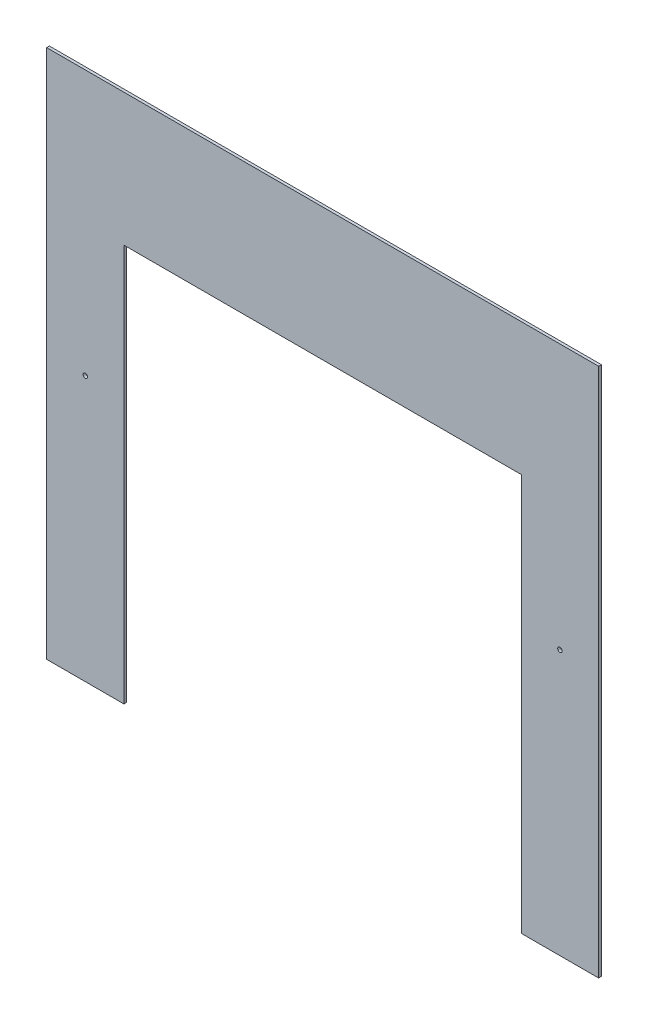
ISO-10303-21;
HEADER;
FILE_DESCRIPTION(('STEP AP214'),'2;1');
FILE_NAME('part.step','',(''),(''),'','','');
FILE_SCHEMA(('AUTOMOTIVE_DESIGN { 1 0 10303 214 1 1 1 1 }'));
ENDSEC;
DATA;
#1=APPLICATION_CONTEXT('core data for automotive mechanical design processes');
#2=APPLICATION_PROTOCOL_DEFINITION('international standard','automotive_design',2000,#1);
#3=PRODUCT_CONTEXT('',#1,'mechanical');
#4=PRODUCT('Part','Part','',(#3));
#5=PRODUCT_RELATED_PRODUCT_CATEGORY('part','',(#4));
#6=PRODUCT_DEFINITION_FORMATION('','',#4);
#7=PRODUCT_DEFINITION_CONTEXT('part definition',#1,'design');
#8=PRODUCT_DEFINITION('design','',#6,#7);
#9=PRODUCT_DEFINITION_SHAPE('','',#8);
#10=(LENGTH_UNIT() NAMED_UNIT(*) SI_UNIT(.MILLI.,.METRE.));
#11=(NAMED_UNIT(*) PLANE_ANGLE_UNIT() SI_UNIT($,.RADIAN.));
#12=(NAMED_UNIT(*) SI_UNIT($,.STERADIAN.) SOLID_ANGLE_UNIT());
#13=UNCERTAINTY_MEASURE_WITH_UNIT(LENGTH_MEASURE(1.E-05),#10,'distance_accuracy_value','');
#14=(GEOMETRIC_REPRESENTATION_CONTEXT(3) GLOBAL_UNCERTAINTY_ASSIGNED_CONTEXT((#13)) GLOBAL_UNIT_ASSIGNED_CONTEXT((#10,
#11,#12)) REPRESENTATION_CONTEXT('',''));
#15=CARTESIAN_POINT('',(0.,0.,0.));
#16=DIRECTION('',(0.,0.,1.));
#17=DIRECTION('',(1.,0.,0.));
#18=AXIS2_PLACEMENT_3D('',#15,#16,#17);
#19=CARTESIAN_POINT('',(-441.395750599632,36.4853300733494,3.175));
#20=DIRECTION('',(1.,0.,0.));
#21=DIRECTION('',(0.,0.,-1.));
#22=AXIS2_PLACEMENT_3D('',#19,#20,#21);
#23=PLANE('',#22);
#24=DIRECTION('',(0.,-1.,0.));
#25=VECTOR('',#24,1.);
#26=CARTESIAN_POINT('',(-441.395750599632,36.4853300733494,0.));
#27=LINE('',#26,#25);
#28=CARTESIAN_POINT('',(-441.395750599632,526.537652811736,0.));
#29=VERTEX_POINT('',#28);
#30=CARTESIAN_POINT('',(-441.395750599632,-83.0623471882642,0.));
#31=VERTEX_POINT('',#30);
#32=EDGE_CURVE('E88',#29,#31,#27,.T.);
#33=ORIENTED_EDGE('',*,*,#32,.T.);
#34=DIRECTION('',(0.,0.,-1.));
#35=VECTOR('',#34,1.);
#36=CARTESIAN_POINT('',(-441.395750599632,-83.0623471882642,3.175));
#37=LINE('',#36,#35);
#38=CARTESIAN_POINT('',(-441.395750599632,-83.0623471882642,3.175));
#39=VERTEX_POINT('',#38);
#40=EDGE_CURVE('E11',#39,#31,#37,.T.);
#41=ORIENTED_EDGE('',*,*,#40,.F.);
#42=DIRECTION('',(0.,-1.,0.));
#43=VECTOR('',#42,1.);
#44=CARTESIAN_POINT('',(-441.395750599632,36.4853300733494,3.175));
#45=LINE('',#44,#43);
#46=CARTESIAN_POINT('',(-441.395750599632,526.537652811736,3.175));
#47=VERTEX_POINT('',#46);
#48=EDGE_CURVE('E94',#47,#39,#45,.T.);
#49=ORIENTED_EDGE('',*,*,#48,.F.);
#50=DIRECTION('',(0.,0.,-1.));
#51=VECTOR('',#50,1.);
#52=CARTESIAN_POINT('',(-441.395750599632,526.537652811736,3.175));
#53=LINE('',#52,#51);
#54=EDGE_CURVE('E128',#47,#29,#53,.T.);
#55=ORIENTED_EDGE('',*,*,#54,.T.);
#56=EDGE_LOOP('',(#33,#41,#49,#55));
#57=FACE_BOUND('',#56,.T.);
#58=ADVANCED_FACE('F36',(#57),#23,.F.);
#59=CARTESIAN_POINT('',(-441.395750599632,-83.0623471882642,3.175));
#60=DIRECTION('',(0.,1.,0.));
#61=DIRECTION('',(0.,0.,1.));
#62=AXIS2_PLACEMENT_3D('',#59,#60,#61);
#63=PLANE('',#62);
#64=DIRECTION('',(1.,0.,0.));
#65=VECTOR('',#64,1.);
#66=CARTESIAN_POINT('',(-441.395750599632,-83.0623471882642,0.));
#67=LINE('',#66,#65);
#68=CARTESIAN_POINT('',(-352.495750599632,-83.0623471882642,0.));
#69=VERTEX_POINT('',#68);
#70=EDGE_CURVE('E133',#31,#69,#67,.T.);
#71=ORIENTED_EDGE('',*,*,#70,.T.);
#72=DIRECTION('',(0.,0.,-1.));
#73=VECTOR('',#72,1.);
#74=CARTESIAN_POINT('',(-352.495750599632,-83.0623471882642,3.175));
#75=LINE('',#74,#73);
#76=CARTESIAN_POINT('',(-352.495750599632,-83.0623471882642,3.175));
#77=VERTEX_POINT('',#76);
#78=EDGE_CURVE('E44',#77,#69,#75,.T.);
#79=ORIENTED_EDGE('',*,*,#78,.F.);
#80=DIRECTION('',(1.,0.,0.));
#81=VECTOR('',#80,1.);
#82=CARTESIAN_POINT('',(-441.395750599632,-83.0623471882642,3.175));
#83=LINE('',#82,#81);
#84=EDGE_CURVE('E178',#39,#77,#83,.T.);
#85=ORIENTED_EDGE('',*,*,#84,.F.);
#86=ORIENTED_EDGE('',*,*,#40,.T.);
#87=EDGE_LOOP('',(#71,#79,#85,#86));
#88=FACE_BOUND('',#87,.T.);
#89=ADVANCED_FACE('F218',(#88),#63,.F.);
#90=CARTESIAN_POINT('',(-352.495750599632,-83.0623471882642,3.175));
#91=DIRECTION('',(-1.,0.,0.));
#92=DIRECTION('',(0.,0.,1.));
#93=AXIS2_PLACEMENT_3D('',#90,#91,#92);
#94=PLANE('',#93);
#95=DIRECTION('',(0.,1.,0.));
#96=VECTOR('',#95,1.);
#97=CARTESIAN_POINT('',(-352.495750599632,-83.0623471882642,0.));
#98=LINE('',#97,#96);
#99=CARTESIAN_POINT('',(-352.495750599632,374.137652811736,0.));
#100=VERTEX_POINT('',#99);
#101=EDGE_CURVE('E136',#69,#100,#98,.T.);
#102=ORIENTED_EDGE('',*,*,#101,.T.);
#103=DIRECTION('',(0.,0.,-1.));
#104=VECTOR('',#103,1.);
#105=CARTESIAN_POINT('',(-352.495750599632,374.137652811736,3.175));
#106=LINE('',#105,#104);
#107=CARTESIAN_POINT('',(-352.495750599632,374.137652811736,3.175));
#108=VERTEX_POINT('',#107);
#109=EDGE_CURVE('E153',#108,#100,#106,.T.);
#110=ORIENTED_EDGE('',*,*,#109,.F.);
#111=DIRECTION('',(0.,1.,0.));
#112=VECTOR('',#111,1.);
#113=CARTESIAN_POINT('',(-352.495750599632,-83.0623471882642,3.175));
#114=LINE('',#113,#112);
#115=EDGE_CURVE('E162',#77,#108,#114,.T.);
#116=ORIENTED_EDGE('',*,*,#115,.F.);
#117=ORIENTED_EDGE('',*,*,#78,.T.);
#118=EDGE_LOOP('',(#102,#110,#116,#117));
#119=FACE_BOUND('',#118,.T.);
#120=ADVANCED_FACE('F160',(#119),#94,.F.);
#121=CARTESIAN_POINT('',(-352.495750599632,374.137652811736,3.175));
#122=DIRECTION('',(0.,1.,0.));
#123=DIRECTION('',(0.,0.,1.));
#124=AXIS2_PLACEMENT_3D('',#121,#122,#123);
#125=PLANE('',#124);
#126=DIRECTION('',(1.,0.,0.));
#127=VECTOR('',#126,1.);
#128=CARTESIAN_POINT('',(-352.495750599632,374.137652811736,0.));
#129=LINE('',#128,#127);
#130=CARTESIAN_POINT('',(104.704249400368,374.137652811736,0.));
#131=VERTEX_POINT('',#130);
#132=EDGE_CURVE('E138',#100,#131,#129,.T.);
#133=ORIENTED_EDGE('',*,*,#132,.T.);
#134=DIRECTION('',(0.,0.,-1.));
#135=VECTOR('',#134,1.);
#136=CARTESIAN_POINT('',(104.704249400368,374.137652811736,3.175));
#137=LINE('',#136,#135);
#138=CARTESIAN_POINT('',(104.704249400368,374.137652811736,3.175));
#139=VERTEX_POINT('',#138);
#140=EDGE_CURVE('E150',#139,#131,#137,.T.);
#141=ORIENTED_EDGE('',*,*,#140,.F.);
#142=DIRECTION('',(1.,0.,0.));
#143=VECTOR('',#142,1.);
#144=CARTESIAN_POINT('',(-352.495750599632,374.137652811736,3.175));
#145=LINE('',#144,#143);
#146=EDGE_CURVE('E174',#108,#139,#145,.T.);
#147=ORIENTED_EDGE('',*,*,#146,.F.);
#148=ORIENTED_EDGE('',*,*,#109,.T.);
#149=EDGE_LOOP('',(#133,#141,#147,#148));
#150=FACE_BOUND('',#149,.T.);
#151=ADVANCED_FACE('F170',(#150),#125,.F.);
#152=CARTESIAN_POINT('',(104.704249400368,-83.0623471882642,3.175));
#153=DIRECTION('',(1.,0.,0.));
#154=DIRECTION('',(0.,1.,0.));
#155=AXIS2_PLACEMENT_3D('',#152,#153,#154);
#156=PLANE('',#155);
#157=DIRECTION('',(0.,-1.,0.));
#158=VECTOR('',#157,1.);
#159=CARTESIAN_POINT('',(104.704249400368,-83.0623471882642,0.));
#160=LINE('',#159,#158);
#161=CARTESIAN_POINT('',(104.704249400368,-83.0623471882642,0.));
#162=VERTEX_POINT('',#161);
#163=EDGE_CURVE('E140',#131,#162,#160,.T.);
#164=ORIENTED_EDGE('',*,*,#163,.T.);
#165=DIRECTION('',(0.,0.,-1.));
#166=VECTOR('',#165,1.);
#167=CARTESIAN_POINT('',(104.704249400368,-83.0623471882642,3.175));
#168=LINE('',#167,#166);
#169=CARTESIAN_POINT('',(104.704249400368,-83.0623471882642,3.175));
#170=VERTEX_POINT('',#169);
#171=EDGE_CURVE('E123',#170,#162,#168,.T.);
#172=ORIENTED_EDGE('',*,*,#171,.F.);
#173=DIRECTION('',(0.,-1.,0.));
#174=VECTOR('',#173,1.);
#175=CARTESIAN_POINT('',(104.704249400368,-83.0623471882642,3.175));
#176=LINE('',#175,#174);
#177=EDGE_CURVE('E114',#139,#170,#176,.T.);
#178=ORIENTED_EDGE('',*,*,#177,.F.);
#179=ORIENTED_EDGE('',*,*,#140,.T.);
#180=EDGE_LOOP('',(#164,#172,#178,#179));
#181=FACE_BOUND('',#180,.T.);
#182=ADVANCED_FACE('F173',(#181),#156,.F.);
#183=CARTESIAN_POINT('',(193.604249400368,-83.0623471882642,3.175));
#184=DIRECTION('',(0.,1.,0.));
#185=DIRECTION('',(0.,0.,1.));
#186=AXIS2_PLACEMENT_3D('',#183,#184,#185);
#187=PLANE('',#186);
#188=DIRECTION('',(1.,0.,0.));
#189=VECTOR('',#188,1.);
#190=CARTESIAN_POINT('',(193.604249400368,-83.0623471882642,0.));
#191=LINE('',#190,#189);
#192=CARTESIAN_POINT('',(193.604249400368,-83.0623471882642,0.));
#193=VERTEX_POINT('',#192);
#194=EDGE_CURVE('E122',#162,#193,#191,.T.);
#195=ORIENTED_EDGE('',*,*,#194,.T.);
#196=DIRECTION('',(0.,0.,-1.));
#197=VECTOR('',#196,1.);
#198=CARTESIAN_POINT('',(193.604249400368,-83.0623471882642,3.175));
#199=LINE('',#198,#197);
#200=CARTESIAN_POINT('',(193.604249400368,-83.0623471882642,3.175));
#201=VERTEX_POINT('',#200);
#202=EDGE_CURVE('E119',#201,#193,#199,.T.);
#203=ORIENTED_EDGE('',*,*,#202,.F.);
#204=DIRECTION('',(1.,0.,0.));
#205=VECTOR('',#204,1.);
#206=CARTESIAN_POINT('',(193.604249400368,-83.0623471882642,3.175));
#207=LINE('',#206,#205);
#208=EDGE_CURVE('E108',#170,#201,#207,.T.);
#209=ORIENTED_EDGE('',*,*,#208,.F.);
#210=ORIENTED_EDGE('',*,*,#171,.T.);
#211=EDGE_LOOP('',(#195,#203,#209,#210));
#212=FACE_BOUND('',#211,.T.);
#213=ADVANCED_FACE('F120',(#212),#187,.F.);
#214=CARTESIAN_POINT('',(193.604249400368,526.537652811736,3.175));
#215=DIRECTION('',(-1.,0.,0.));
#216=DIRECTION('',(0.,-1.,0.));
#217=AXIS2_PLACEMENT_3D('',#214,#215,#216);
#218=PLANE('',#217);
#219=DIRECTION('',(0.,1.,0.));
#220=VECTOR('',#219,1.);
#221=CARTESIAN_POINT('',(193.604249400368,526.537652811736,0.));
#222=LINE('',#221,#220);
#223=CARTESIAN_POINT('',(193.604249400368,526.537652811736,0.));
#224=VERTEX_POINT('',#223);
#225=EDGE_CURVE('E81',#193,#224,#222,.T.);
#226=ORIENTED_EDGE('',*,*,#225,.T.);
#227=DIRECTION('',(0.,0.,-1.));
#228=VECTOR('',#227,1.);
#229=CARTESIAN_POINT('',(193.604249400368,526.537652811736,3.175));
#230=LINE('',#229,#228);
#231=CARTESIAN_POINT('',(193.604249400368,526.537652811736,3.175));
#232=VERTEX_POINT('',#231);
#233=EDGE_CURVE('E124',#232,#224,#230,.T.);
#234=ORIENTED_EDGE('',*,*,#233,.F.);
#235=DIRECTION('',(0.,1.,0.));
#236=VECTOR('',#235,1.);
#237=CARTESIAN_POINT('',(193.604249400368,526.537652811736,3.175));
#238=LINE('',#237,#236);
#239=EDGE_CURVE('E112',#201,#232,#238,.T.);
#240=ORIENTED_EDGE('',*,*,#239,.F.);
#241=ORIENTED_EDGE('',*,*,#202,.T.);
#242=EDGE_LOOP('',(#226,#234,#240,#241));
#243=FACE_BOUND('',#242,.T.);
#244=ADVANCED_FACE('F126',(#243),#218,.F.);
#245=CARTESIAN_POINT('',(-441.395750599632,526.537652811736,3.175));
#246=DIRECTION('',(0.,-1.,0.));
#247=DIRECTION('',(0.,0.,-1.));
#248=AXIS2_PLACEMENT_3D('',#245,#246,#247);
#249=PLANE('',#248);
#250=DIRECTION('',(-1.,0.,0.));
#251=VECTOR('',#250,1.);
#252=CARTESIAN_POINT('',(-441.395750599632,526.537652811736,0.));
#253=LINE('',#252,#251);
#254=EDGE_CURVE('E144',#224,#29,#253,.T.);
#255=ORIENTED_EDGE('',*,*,#254,.T.);
#256=ORIENTED_EDGE('',*,*,#54,.F.);
#257=DIRECTION('',(-1.,0.,0.));
#258=VECTOR('',#257,1.);
#259=CARTESIAN_POINT('',(-441.395750599632,526.537652811736,3.175));
#260=LINE('',#259,#258);
#261=EDGE_CURVE('E52',#232,#47,#260,.T.);
#262=ORIENTED_EDGE('',*,*,#261,.F.);
#263=ORIENTED_EDGE('',*,*,#233,.T.);
#264=EDGE_LOOP('',(#255,#256,#262,#263));
#265=FACE_BOUND('',#264,.T.);
#266=ADVANCED_FACE('F204',(#265),#249,.F.);
#267=CARTESIAN_POINT('',(0.,0.,3.175));
#268=DIRECTION('',(0.,0.,-1.));
#269=DIRECTION('',(-1.,0.,0.));
#270=AXIS2_PLACEMENT_3D('',#267,#268,#269);
#271=PLANE('',#270);
#272=CARTESIAN_POINT('',(-396.945750599632,221.737652811736,3.175));
#273=DIRECTION('',(0.,0.,1.));
#274=DIRECTION('',(1.,0.,0.));
#275=AXIS2_PLACEMENT_3D('',#272,#273,#274);
#276=CIRCLE('',#275,2.57968750000001);
#277=CARTESIAN_POINT('',(-394.366063099632,221.737652811736,3.175));
#278=VERTEX_POINT('',#277);
#279=EDGE_CURVE('E187',#278,#278,#276,.T.);
#280=ORIENTED_EDGE('',*,*,#279,.F.);
#281=EDGE_LOOP('',(#280));
#282=FACE_BOUND('',#281,.T.);
#283=CARTESIAN_POINT('',(149.154249400368,221.737652811736,3.175));
#284=DIRECTION('',(0.,0.,1.));
#285=DIRECTION('',(1.,0.,0.));
#286=AXIS2_PLACEMENT_3D('',#283,#284,#285);
#287=CIRCLE('',#286,2.57968750000001);
#288=CARTESIAN_POINT('',(151.733936900368,221.737652811736,3.175));
#289=VERTEX_POINT('',#288);
#290=EDGE_CURVE('E181',#289,#289,#287,.T.);
#291=ORIENTED_EDGE('',*,*,#290,.F.);
#292=EDGE_LOOP('',(#291));
#293=FACE_BOUND('',#292,.T.);
#294=ORIENTED_EDGE('',*,*,#48,.T.);
#295=ORIENTED_EDGE('',*,*,#84,.T.);
#296=ORIENTED_EDGE('',*,*,#115,.T.);
#297=ORIENTED_EDGE('',*,*,#146,.T.);
#298=ORIENTED_EDGE('',*,*,#177,.T.);
#299=ORIENTED_EDGE('',*,*,#208,.T.);
#300=ORIENTED_EDGE('',*,*,#239,.T.);
#301=ORIENTED_EDGE('',*,*,#261,.T.);
#302=EDGE_LOOP('',(#294,#295,#296,#297,#298,#299,#300,#301));
#303=FACE_BOUND('',#302,.T.);
#304=ADVANCED_FACE('F110',(#282,#293,#303),#271,.F.);
#305=CARTESIAN_POINT('',(0.,0.,0.));
#306=DIRECTION('',(0.,0.,-1.));
#307=DIRECTION('',(-1.,0.,0.));
#308=AXIS2_PLACEMENT_3D('',#305,#306,#307);
#309=PLANE('',#308);
#310=CARTESIAN_POINT('',(-396.945750599632,221.737652811736,0.));
#311=DIRECTION('',(0.,0.,1.));
#312=DIRECTION('',(1.,0.,0.));
#313=AXIS2_PLACEMENT_3D('',#310,#311,#312);
#314=CIRCLE('',#313,2.57968750000001);
#315=CARTESIAN_POINT('',(-394.366063099632,221.737652811736,0.));
#316=VERTEX_POINT('',#315);
#317=EDGE_CURVE('E134',#316,#316,#314,.T.);
#318=ORIENTED_EDGE('',*,*,#317,.T.);
#319=EDGE_LOOP('',(#318));
#320=FACE_BOUND('',#319,.T.);
#321=CARTESIAN_POINT('',(149.154249400368,221.737652811736,0.));
#322=DIRECTION('',(0.,0.,1.));
#323=DIRECTION('',(1.,0.,0.));
#324=AXIS2_PLACEMENT_3D('',#321,#322,#323);
#325=CIRCLE('',#324,2.57968750000001);
#326=CARTESIAN_POINT('',(151.733936900368,221.737652811736,0.));
#327=VERTEX_POINT('',#326);
#328=EDGE_CURVE('E184',#327,#327,#325,.T.);
#329=ORIENTED_EDGE('',*,*,#328,.T.);
#330=EDGE_LOOP('',(#329));
#331=FACE_BOUND('',#330,.T.);
#332=ORIENTED_EDGE('',*,*,#32,.F.);
#333=ORIENTED_EDGE('',*,*,#254,.F.);
#334=ORIENTED_EDGE('',*,*,#225,.F.);
#335=ORIENTED_EDGE('',*,*,#194,.F.);
#336=ORIENTED_EDGE('',*,*,#163,.F.);
#337=ORIENTED_EDGE('',*,*,#132,.F.);
#338=ORIENTED_EDGE('',*,*,#101,.F.);
#339=ORIENTED_EDGE('',*,*,#70,.F.);
#340=EDGE_LOOP('',(#332,#333,#334,#335,#336,#337,#338,#339));
#341=FACE_BOUND('',#340,.T.);
#342=ADVANCED_FACE('F166',(#320,#331,#341),#309,.T.);
#343=CARTESIAN_POINT('',(149.154249400368,221.737652811736,0.));
#344=DIRECTION('',(0.,0.,1.));
#345=DIRECTION('',(1.,0.,0.));
#346=AXIS2_PLACEMENT_3D('',#343,#344,#345);
#347=CYLINDRICAL_SURFACE('',#346,2.57968750000001);
#348=ORIENTED_EDGE('',*,*,#328,.F.);
#349=EDGE_LOOP('',(#348));
#350=FACE_BOUND('',#349,.T.);
#351=ORIENTED_EDGE('',*,*,#290,.T.);
#352=EDGE_LOOP('',(#351));
#353=FACE_BOUND('',#352,.T.);
#354=ADVANCED_FACE('F198',(#350,#353),#347,.F.);
#355=CARTESIAN_POINT('',(-396.945750599632,221.737652811736,0.));
#356=DIRECTION('',(0.,0.,1.));
#357=DIRECTION('',(1.,0.,0.));
#358=AXIS2_PLACEMENT_3D('',#355,#356,#357);
#359=CYLINDRICAL_SURFACE('',#358,2.57968750000001);
#360=ORIENTED_EDGE('',*,*,#317,.F.);
#361=EDGE_LOOP('',(#360));
#362=FACE_BOUND('',#361,.T.);
#363=ORIENTED_EDGE('',*,*,#279,.T.);
#364=EDGE_LOOP('',(#363));
#365=FACE_BOUND('',#364,.T.);
#366=ADVANCED_FACE('F195',(#362,#365),#359,.F.);
#367=CLOSED_SHELL('',(#58,#89,#120,#151,#182,#213,#244,#266,#304,#342,#354,#366));
#368=MANIFOLD_SOLID_BREP('B2',#367);
#369=ADVANCED_BREP_SHAPE_REPRESENTATION('',(#18,#368),#14);
#370=SHAPE_DEFINITION_REPRESENTATION(#9,#369);
ENDSEC;
END-ISO-10303-21;
